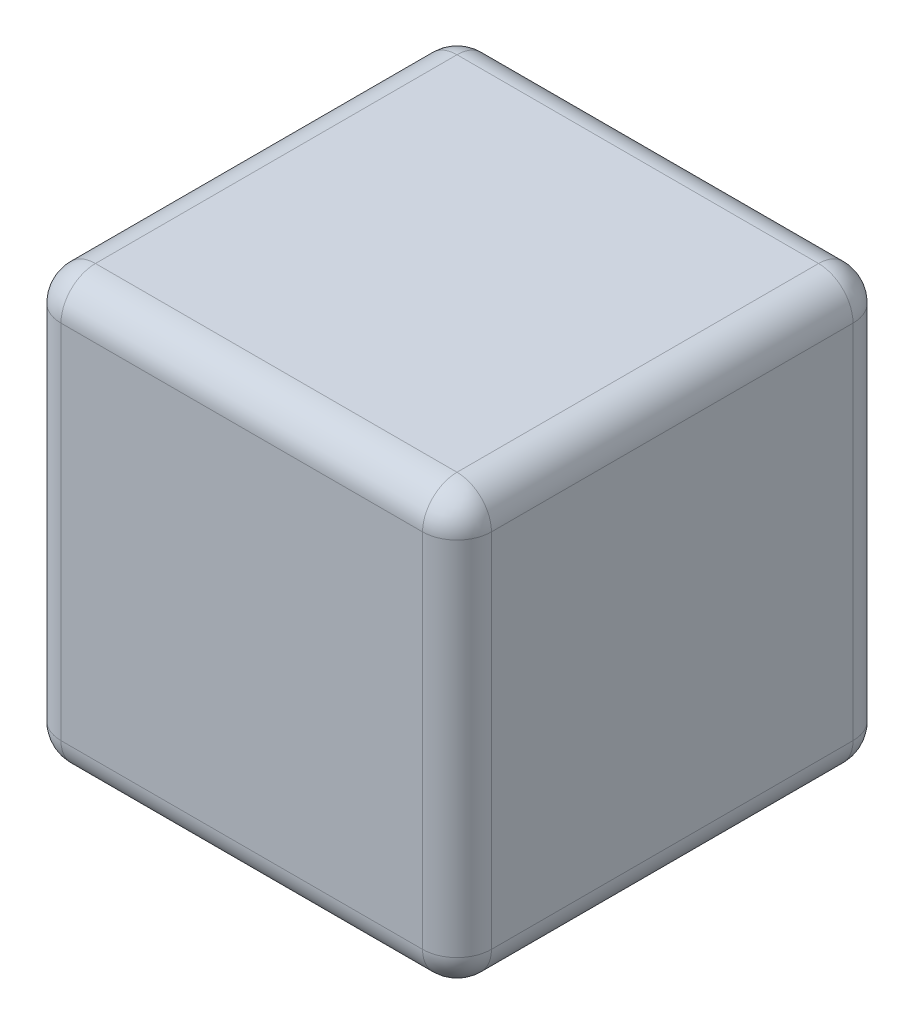
ISO-10303-21;
HEADER;
FILE_DESCRIPTION(('STEP AP214'),'2;1');
FILE_NAME('part.step','',(''),(''),'','','');
FILE_SCHEMA(('AUTOMOTIVE_DESIGN { 1 0 10303 214 1 1 1 1 }'));
ENDSEC;
DATA;
#1=APPLICATION_CONTEXT('core data for automotive mechanical design processes');
#2=APPLICATION_PROTOCOL_DEFINITION('international standard','automotive_design',2000,#1);
#3=PRODUCT_CONTEXT('',#1,'mechanical');
#4=PRODUCT('Part','Part','',(#3));
#5=PRODUCT_RELATED_PRODUCT_CATEGORY('part','',(#4));
#6=PRODUCT_DEFINITION_FORMATION('','',#4);
#7=PRODUCT_DEFINITION_CONTEXT('part definition',#1,'design');
#8=PRODUCT_DEFINITION('design','',#6,#7);
#9=PRODUCT_DEFINITION_SHAPE('','',#8);
#10=(LENGTH_UNIT() NAMED_UNIT(*) SI_UNIT(.MILLI.,.METRE.));
#11=(NAMED_UNIT(*) PLANE_ANGLE_UNIT() SI_UNIT($,.RADIAN.));
#12=(NAMED_UNIT(*) SI_UNIT($,.STERADIAN.) SOLID_ANGLE_UNIT());
#13=UNCERTAINTY_MEASURE_WITH_UNIT(LENGTH_MEASURE(1.E-05),#10,'distance_accuracy_value','');
#14=(GEOMETRIC_REPRESENTATION_CONTEXT(3) GLOBAL_UNCERTAINTY_ASSIGNED_CONTEXT((#13)) GLOBAL_UNIT_ASSIGNED_CONTEXT((#10,
#11,#12)) REPRESENTATION_CONTEXT('',''));
#15=CARTESIAN_POINT('',(0.,0.,0.));
#16=DIRECTION('',(0.,0.,1.));
#17=DIRECTION('',(1.,0.,0.));
#18=AXIS2_PLACEMENT_3D('',#15,#16,#17);
#19=CARTESIAN_POINT('',(31.75,31.75,0.));
#20=DIRECTION('',(0.,0.,-1.));
#21=DIRECTION('',(-1.,0.,0.));
#22=AXIS2_PLACEMENT_3D('',#19,#20,#21);
#23=PLANE('',#22);
#24=DIRECTION('',(0.,-1.,0.));
#25=VECTOR('',#24,1.);
#26=CARTESIAN_POINT('',(2.54,31.75,0.));
#27=LINE('',#26,#25);
#28=CARTESIAN_POINT('',(2.54,29.21,0.));
#29=VERTEX_POINT('',#28);
#30=CARTESIAN_POINT('',(2.54,2.54,0.));
#31=VERTEX_POINT('',#30);
#32=EDGE_CURVE('E170',#29,#31,#27,.T.);
#33=ORIENTED_EDGE('',*,*,#32,.T.);
#34=DIRECTION('',(1.,0.,0.));
#35=VECTOR('',#34,1.);
#36=CARTESIAN_POINT('',(31.75,2.54,0.));
#37=LINE('',#36,#35);
#38=CARTESIAN_POINT('',(29.21,2.54,0.));
#39=VERTEX_POINT('',#38);
#40=EDGE_CURVE('E140',#31,#39,#37,.T.);
#41=ORIENTED_EDGE('',*,*,#40,.T.);
#42=DIRECTION('',(0.,-1.,0.));
#43=VECTOR('',#42,1.);
#44=CARTESIAN_POINT('',(29.21,31.75,0.));
#45=LINE('',#44,#43);
#46=CARTESIAN_POINT('',(29.21,29.21,0.));
#47=VERTEX_POINT('',#46);
#48=EDGE_CURVE('E160',#39,#47,#45,.F.);
#49=ORIENTED_EDGE('',*,*,#48,.T.);
#50=DIRECTION('',(1.,0.,0.));
#51=VECTOR('',#50,1.);
#52=CARTESIAN_POINT('',(31.75,29.21,0.));
#53=LINE('',#52,#51);
#54=EDGE_CURVE('E167',#47,#29,#53,.F.);
#55=ORIENTED_EDGE('',*,*,#54,.T.);
#56=EDGE_LOOP('',(#33,#41,#49,#55));
#57=FACE_BOUND('',#56,.T.);
#58=ADVANCED_FACE('F45',(#57),#23,.F.);
#59=CARTESIAN_POINT('',(31.75,31.75,-31.75));
#60=DIRECTION('',(-1.,0.,0.));
#61=DIRECTION('',(0.,0.,1.));
#62=AXIS2_PLACEMENT_3D('',#59,#60,#61);
#63=PLANE('',#62);
#64=DIRECTION('',(0.,0.,-1.));
#65=VECTOR('',#64,1.);
#66=CARTESIAN_POINT('',(31.75,29.21,-31.75));
#67=LINE('',#66,#65);
#68=CARTESIAN_POINT('',(31.75,29.21,-29.21));
#69=VERTEX_POINT('',#68);
#70=CARTESIAN_POINT('',(31.75,29.21,-2.54));
#71=VERTEX_POINT('',#70);
#72=EDGE_CURVE('E55',#69,#71,#67,.F.);
#73=ORIENTED_EDGE('',*,*,#72,.T.);
#74=DIRECTION('',(0.,-1.,0.));
#75=VECTOR('',#74,1.);
#76=CARTESIAN_POINT('',(31.75,31.75,-2.54));
#77=LINE('',#76,#75);
#78=CARTESIAN_POINT('',(31.75,2.54,-2.54));
#79=VERTEX_POINT('',#78);
#80=EDGE_CURVE('E11',#71,#79,#77,.T.);
#81=ORIENTED_EDGE('',*,*,#80,.T.);
#82=DIRECTION('',(0.,0.,-1.));
#83=VECTOR('',#82,1.);
#84=CARTESIAN_POINT('',(31.75,2.54,-31.75));
#85=LINE('',#84,#83);
#86=CARTESIAN_POINT('',(31.75,2.54,-29.21));
#87=VERTEX_POINT('',#86);
#88=EDGE_CURVE('E228',#79,#87,#85,.T.);
#89=ORIENTED_EDGE('',*,*,#88,.T.);
#90=DIRECTION('',(0.,-1.,0.));
#91=VECTOR('',#90,1.);
#92=CARTESIAN_POINT('',(31.75,31.75,-29.21));
#93=LINE('',#92,#91);
#94=EDGE_CURVE('E66',#87,#69,#93,.F.);
#95=ORIENTED_EDGE('',*,*,#94,.T.);
#96=EDGE_LOOP('',(#73,#81,#89,#95));
#97=FACE_BOUND('',#96,.T.);
#98=ADVANCED_FACE('F368',(#97),#63,.F.);
#99=CARTESIAN_POINT('',(0.,31.75,-31.75));
#100=DIRECTION('',(0.,0.,1.));
#101=DIRECTION('',(1.,0.,0.));
#102=AXIS2_PLACEMENT_3D('',#99,#100,#101);
#103=PLANE('',#102);
#104=DIRECTION('',(-1.,0.,0.));
#105=VECTOR('',#104,1.);
#106=CARTESIAN_POINT('',(0.,2.54,-31.75));
#107=LINE('',#106,#105);
#108=CARTESIAN_POINT('',(29.21,2.54,-31.75));
#109=VERTEX_POINT('',#108);
#110=CARTESIAN_POINT('',(2.54,2.54,-31.75));
#111=VERTEX_POINT('',#110);
#112=EDGE_CURVE('E208',#109,#111,#107,.T.);
#113=ORIENTED_EDGE('',*,*,#112,.T.);
#114=DIRECTION('',(0.,-1.,0.));
#115=VECTOR('',#114,1.);
#116=CARTESIAN_POINT('',(2.54,31.75,-31.75));
#117=LINE('',#116,#115);
#118=CARTESIAN_POINT('',(2.54,29.21,-31.75));
#119=VERTEX_POINT('',#118);
#120=EDGE_CURVE('E211',#111,#119,#117,.F.);
#121=ORIENTED_EDGE('',*,*,#120,.T.);
#122=DIRECTION('',(-1.,0.,0.));
#123=VECTOR('',#122,1.);
#124=CARTESIAN_POINT('',(0.,29.21,-31.75));
#125=LINE('',#124,#123);
#126=CARTESIAN_POINT('',(29.21,29.21,-31.75));
#127=VERTEX_POINT('',#126);
#128=EDGE_CURVE('E205',#119,#127,#125,.F.);
#129=ORIENTED_EDGE('',*,*,#128,.T.);
#130=DIRECTION('',(0.,-1.,0.));
#131=VECTOR('',#130,1.);
#132=CARTESIAN_POINT('',(29.21,31.75,-31.75));
#133=LINE('',#132,#131);
#134=EDGE_CURVE('E202',#127,#109,#133,.T.);
#135=ORIENTED_EDGE('',*,*,#134,.T.);
#136=EDGE_LOOP('',(#113,#121,#129,#135));
#137=FACE_BOUND('',#136,.T.);
#138=ADVANCED_FACE('F324',(#137),#103,.F.);
#139=CARTESIAN_POINT('',(0.,31.75,0.));
#140=DIRECTION('',(1.,0.,0.));
#141=DIRECTION('',(0.,0.,-1.));
#142=AXIS2_PLACEMENT_3D('',#139,#140,#141);
#143=PLANE('',#142);
#144=DIRECTION('',(0.,0.,1.));
#145=VECTOR('',#144,1.);
#146=CARTESIAN_POINT('',(0.,2.54,0.));
#147=LINE('',#146,#145);
#148=CARTESIAN_POINT('',(0.,2.54,-29.21));
#149=VERTEX_POINT('',#148);
#150=CARTESIAN_POINT('',(0.,2.54,-2.54));
#151=VERTEX_POINT('',#150);
#152=EDGE_CURVE('E195',#149,#151,#147,.T.);
#153=ORIENTED_EDGE('',*,*,#152,.T.);
#154=DIRECTION('',(0.,-1.,0.));
#155=VECTOR('',#154,1.);
#156=CARTESIAN_POINT('',(0.,31.75,-2.54));
#157=LINE('',#156,#155);
#158=CARTESIAN_POINT('',(0.,29.21,-2.54));
#159=VERTEX_POINT('',#158);
#160=EDGE_CURVE('E198',#151,#159,#157,.F.);
#161=ORIENTED_EDGE('',*,*,#160,.T.);
#162=DIRECTION('',(0.,0.,1.));
#163=VECTOR('',#162,1.);
#164=CARTESIAN_POINT('',(0.,29.21,0.));
#165=LINE('',#164,#163);
#166=CARTESIAN_POINT('',(0.,29.21,-29.21));
#167=VERTEX_POINT('',#166);
#168=EDGE_CURVE('E189',#159,#167,#165,.F.);
#169=ORIENTED_EDGE('',*,*,#168,.T.);
#170=DIRECTION('',(0.,-1.,0.));
#171=VECTOR('',#170,1.);
#172=CARTESIAN_POINT('',(0.,31.75,-29.21));
#173=LINE('',#172,#171);
#174=EDGE_CURVE('E192',#167,#149,#173,.T.);
#175=ORIENTED_EDGE('',*,*,#174,.T.);
#176=EDGE_LOOP('',(#153,#161,#169,#175));
#177=FACE_BOUND('',#176,.T.);
#178=ADVANCED_FACE('F345',(#177),#143,.F.);
#179=CARTESIAN_POINT('',(0.,31.75,0.));
#180=DIRECTION('',(0.,-1.,0.));
#181=DIRECTION('',(0.,0.,-1.));
#182=AXIS2_PLACEMENT_3D('',#179,#180,#181);
#183=PLANE('',#182);
#184=DIRECTION('',(-1.,0.,0.));
#185=VECTOR('',#184,1.);
#186=CARTESIAN_POINT('',(0.,31.75,-29.21));
#187=LINE('',#186,#185);
#188=CARTESIAN_POINT('',(29.21,31.75,-29.21));
#189=VERTEX_POINT('',#188);
#190=CARTESIAN_POINT('',(2.54,31.75,-29.21));
#191=VERTEX_POINT('',#190);
#192=EDGE_CURVE('E221',#189,#191,#187,.T.);
#193=ORIENTED_EDGE('',*,*,#192,.T.);
#194=DIRECTION('',(0.,0.,1.));
#195=VECTOR('',#194,1.);
#196=CARTESIAN_POINT('',(2.54,31.75,0.));
#197=LINE('',#196,#195);
#198=CARTESIAN_POINT('',(2.54,31.75,-2.54));
#199=VERTEX_POINT('',#198);
#200=EDGE_CURVE('E224',#191,#199,#197,.T.);
#201=ORIENTED_EDGE('',*,*,#200,.T.);
#202=DIRECTION('',(1.,0.,0.));
#203=VECTOR('',#202,1.);
#204=CARTESIAN_POINT('',(0.,31.75,-2.54));
#205=LINE('',#204,#203);
#206=CARTESIAN_POINT('',(29.21,31.75,-2.54));
#207=VERTEX_POINT('',#206);
#208=EDGE_CURVE('E218',#199,#207,#205,.T.);
#209=ORIENTED_EDGE('',*,*,#208,.T.);
#210=DIRECTION('',(0.,0.,-1.));
#211=VECTOR('',#210,1.);
#212=CARTESIAN_POINT('',(29.21,31.75,0.));
#213=LINE('',#212,#211);
#214=EDGE_CURVE('E215',#207,#189,#213,.T.);
#215=ORIENTED_EDGE('',*,*,#214,.T.);
#216=EDGE_LOOP('',(#193,#201,#209,#215));
#217=FACE_BOUND('',#216,.T.);
#218=ADVANCED_FACE('F359',(#217),#183,.F.);
#219=CARTESIAN_POINT('',(0.,0.,0.));
#220=DIRECTION('',(0.,-1.,0.));
#221=DIRECTION('',(0.,0.,-1.));
#222=AXIS2_PLACEMENT_3D('',#219,#220,#221);
#223=PLANE('',#222);
#224=DIRECTION('',(0.,0.,-1.));
#225=VECTOR('',#224,1.);
#226=CARTESIAN_POINT('',(29.21,0.,0.));
#227=LINE('',#226,#225);
#228=CARTESIAN_POINT('',(29.21,0.,-29.21));
#229=VERTEX_POINT('',#228);
#230=CARTESIAN_POINT('',(29.21,0.,-2.54));
#231=VERTEX_POINT('',#230);
#232=EDGE_CURVE('E173',#229,#231,#227,.F.);
#233=ORIENTED_EDGE('',*,*,#232,.T.);
#234=DIRECTION('',(1.,0.,0.));
#235=VECTOR('',#234,1.);
#236=CARTESIAN_POINT('',(0.,0.,-2.54));
#237=LINE('',#236,#235);
#238=CARTESIAN_POINT('',(2.54,0.,-2.54));
#239=VERTEX_POINT('',#238);
#240=EDGE_CURVE('E142',#231,#239,#237,.F.);
#241=ORIENTED_EDGE('',*,*,#240,.T.);
#242=DIRECTION('',(0.,0.,1.));
#243=VECTOR('',#242,1.);
#244=CARTESIAN_POINT('',(2.54,0.,-31.75));
#245=LINE('',#244,#243);
#246=CARTESIAN_POINT('',(2.54,0.,-29.21));
#247=VERTEX_POINT('',#246);
#248=EDGE_CURVE('E184',#239,#247,#245,.F.);
#249=ORIENTED_EDGE('',*,*,#248,.T.);
#250=DIRECTION('',(-1.,0.,0.));
#251=VECTOR('',#250,1.);
#252=CARTESIAN_POINT('',(31.75,0.,-29.21));
#253=LINE('',#252,#251);
#254=EDGE_CURVE('E177',#247,#229,#253,.F.);
#255=ORIENTED_EDGE('',*,*,#254,.T.);
#256=EDGE_LOOP('',(#233,#241,#249,#255));
#257=FACE_BOUND('',#256,.T.);
#258=ADVANCED_FACE('F379',(#257),#223,.T.);
#259=CARTESIAN_POINT('',(0.,29.21,-29.21));
#260=DIRECTION('',(-1.,0.,0.));
#261=DIRECTION('',(0.,0.,1.));
#262=AXIS2_PLACEMENT_3D('',#259,#260,#261);
#263=CYLINDRICAL_SURFACE('',#262,2.54);
#264=CARTESIAN_POINT('',(2.54,29.21,-29.21));
#265=DIRECTION('',(-1.,0.,0.));
#266=DIRECTION('',(0.,0.,1.));
#267=AXIS2_PLACEMENT_3D('',#264,#265,#266);
#268=CIRCLE('',#267,2.54);
#269=EDGE_CURVE('E49',#191,#119,#268,.T.);
#270=ORIENTED_EDGE('',*,*,#269,.F.);
#271=ORIENTED_EDGE('',*,*,#192,.F.);
#272=CARTESIAN_POINT('',(29.21,29.21,-29.21));
#273=DIRECTION('',(1.,0.,0.));
#274=DIRECTION('',(0.,0.,-1.));
#275=AXIS2_PLACEMENT_3D('',#272,#273,#274);
#276=CIRCLE('',#275,2.54);
#277=EDGE_CURVE('E303',#127,#189,#276,.T.);
#278=ORIENTED_EDGE('',*,*,#277,.F.);
#279=ORIENTED_EDGE('',*,*,#128,.F.);
#280=EDGE_LOOP('',(#270,#271,#278,#279));
#281=FACE_BOUND('',#280,.T.);
#282=ADVANCED_FACE('F47',(#281),#263,.T.);
#283=CARTESIAN_POINT('',(2.54,29.21,-29.21));
#284=DIRECTION('',(0.,0.,-1.));
#285=DIRECTION('',(-1.,0.,0.));
#286=AXIS2_PLACEMENT_3D('',#283,#284,#285);
#287=SPHERICAL_SURFACE('',#286,2.54);
#288=CARTESIAN_POINT('',(2.54,29.21,-29.21));
#289=DIRECTION('',(0.,0.,-1.));
#290=DIRECTION('',(-1.,0.,0.));
#291=AXIS2_PLACEMENT_3D('',#288,#289,#290);
#292=CIRCLE('',#291,2.54);
#293=EDGE_CURVE('E297',#191,#167,#292,.F.);
#294=ORIENTED_EDGE('',*,*,#293,.F.);
#295=ORIENTED_EDGE('',*,*,#269,.T.);
#296=CARTESIAN_POINT('',(2.54,29.21,-29.21));
#297=DIRECTION('',(0.,1.,0.));
#298=DIRECTION('',(0.,0.,1.));
#299=AXIS2_PLACEMENT_3D('',#296,#297,#298);
#300=CIRCLE('',#299,2.54);
#301=EDGE_CURVE('E301',#167,#119,#300,.F.);
#302=ORIENTED_EDGE('',*,*,#301,.F.);
#303=EDGE_LOOP('',(#294,#295,#302));
#304=FACE_BOUND('',#303,.T.);
#305=ADVANCED_FACE('F317',(#304),#287,.T.);
#306=CARTESIAN_POINT('',(29.21,29.21,-29.21));
#307=DIRECTION('',(0.,1.,0.));
#308=DIRECTION('',(0.,0.,1.));
#309=AXIS2_PLACEMENT_3D('',#306,#307,#308);
#310=SPHERICAL_SURFACE('',#309,2.54);
#311=CARTESIAN_POINT('',(29.21,29.21,-29.21));
#312=DIRECTION('',(0.,1.,0.));
#313=DIRECTION('',(0.,0.,1.));
#314=AXIS2_PLACEMENT_3D('',#311,#312,#313);
#315=CIRCLE('',#314,2.54);
#316=EDGE_CURVE('E290',#127,#69,#315,.F.);
#317=ORIENTED_EDGE('',*,*,#316,.F.);
#318=ORIENTED_EDGE('',*,*,#277,.T.);
#319=CARTESIAN_POINT('',(29.21,29.21,-29.21));
#320=DIRECTION('',(0.,0.,-1.));
#321=DIRECTION('',(-1.,0.,0.));
#322=AXIS2_PLACEMENT_3D('',#319,#320,#321);
#323=CIRCLE('',#322,2.54);
#324=EDGE_CURVE('E293',#69,#189,#323,.F.);
#325=ORIENTED_EDGE('',*,*,#324,.F.);
#326=EDGE_LOOP('',(#317,#318,#325));
#327=FACE_BOUND('',#326,.T.);
#328=ADVANCED_FACE('F432',(#327),#310,.T.);
#329=CARTESIAN_POINT('',(2.54,31.75,-29.21));
#330=DIRECTION('',(0.,-1.,0.));
#331=DIRECTION('',(0.,0.,-1.));
#332=AXIS2_PLACEMENT_3D('',#329,#330,#331);
#333=CYLINDRICAL_SURFACE('',#332,2.54);
#334=ORIENTED_EDGE('',*,*,#301,.T.);
#335=ORIENTED_EDGE('',*,*,#120,.F.);
#336=CARTESIAN_POINT('',(2.54,2.54,-29.21));
#337=DIRECTION('',(0.,-1.,0.));
#338=DIRECTION('',(0.,0.,-1.));
#339=AXIS2_PLACEMENT_3D('',#336,#337,#338);
#340=CIRCLE('',#339,2.54);
#341=EDGE_CURVE('E282',#149,#111,#340,.T.);
#342=ORIENTED_EDGE('',*,*,#341,.F.);
#343=ORIENTED_EDGE('',*,*,#174,.F.);
#344=EDGE_LOOP('',(#334,#335,#342,#343));
#345=FACE_BOUND('',#344,.T.);
#346=ADVANCED_FACE('F329',(#345),#333,.T.);
#347=CARTESIAN_POINT('',(2.54,29.21,0.));
#348=DIRECTION('',(0.,0.,1.));
#349=DIRECTION('',(1.,0.,0.));
#350=AXIS2_PLACEMENT_3D('',#347,#348,#349);
#351=CYLINDRICAL_SURFACE('',#350,2.54);
#352=ORIENTED_EDGE('',*,*,#293,.T.);
#353=ORIENTED_EDGE('',*,*,#168,.F.);
#354=CARTESIAN_POINT('',(2.54,29.21,-2.54));
#355=DIRECTION('',(0.,0.,1.));
#356=DIRECTION('',(1.,0.,0.));
#357=AXIS2_PLACEMENT_3D('',#354,#355,#356);
#358=CIRCLE('',#357,2.54);
#359=EDGE_CURVE('E278',#199,#159,#358,.T.);
#360=ORIENTED_EDGE('',*,*,#359,.F.);
#361=ORIENTED_EDGE('',*,*,#200,.F.);
#362=EDGE_LOOP('',(#352,#353,#360,#361));
#363=FACE_BOUND('',#362,.T.);
#364=ADVANCED_FACE('F357',(#363),#351,.T.);
#365=CARTESIAN_POINT('',(0.,29.21,-2.54));
#366=DIRECTION('',(1.,0.,0.));
#367=DIRECTION('',(0.,0.,-1.));
#368=AXIS2_PLACEMENT_3D('',#365,#366,#367);
#369=CYLINDRICAL_SURFACE('',#368,2.54);
#370=CARTESIAN_POINT('',(29.21,29.21,-2.54));
#371=DIRECTION('',(1.,0.,0.));
#372=DIRECTION('',(0.,0.,-1.));
#373=AXIS2_PLACEMENT_3D('',#370,#371,#372);
#374=CIRCLE('',#373,2.54);
#375=EDGE_CURVE('E271',#207,#47,#374,.T.);
#376=ORIENTED_EDGE('',*,*,#375,.F.);
#377=ORIENTED_EDGE('',*,*,#208,.F.);
#378=CARTESIAN_POINT('',(2.54,29.21,-2.54));
#379=DIRECTION('',(-1.,0.,0.));
#380=DIRECTION('',(0.,-1.,0.));
#381=AXIS2_PLACEMENT_3D('',#378,#379,#380);
#382=CIRCLE('',#381,2.54);
#383=EDGE_CURVE('E275',#29,#199,#382,.T.);
#384=ORIENTED_EDGE('',*,*,#383,.F.);
#385=ORIENTED_EDGE('',*,*,#54,.F.);
#386=EDGE_LOOP('',(#376,#377,#384,#385));
#387=FACE_BOUND('',#386,.T.);
#388=ADVANCED_FACE('F365',(#387),#369,.T.);
#389=CARTESIAN_POINT('',(29.21,29.21,0.));
#390=DIRECTION('',(0.,0.,-1.));
#391=DIRECTION('',(-1.,0.,0.));
#392=AXIS2_PLACEMENT_3D('',#389,#390,#391);
#393=CYLINDRICAL_SURFACE('',#392,2.54);
#394=ORIENTED_EDGE('',*,*,#324,.T.);
#395=ORIENTED_EDGE('',*,*,#214,.F.);
#396=CARTESIAN_POINT('',(29.21,29.21,-2.54));
#397=DIRECTION('',(0.,0.,1.));
#398=DIRECTION('',(0.,-1.,0.));
#399=AXIS2_PLACEMENT_3D('',#396,#397,#398);
#400=CIRCLE('',#399,2.54);
#401=EDGE_CURVE('E267',#71,#207,#400,.T.);
#402=ORIENTED_EDGE('',*,*,#401,.F.);
#403=ORIENTED_EDGE('',*,*,#72,.F.);
#404=EDGE_LOOP('',(#394,#395,#402,#403));
#405=FACE_BOUND('',#404,.T.);
#406=ADVANCED_FACE('F363',(#405),#393,.T.);
#407=CARTESIAN_POINT('',(29.21,31.75,-29.21));
#408=DIRECTION('',(0.,-1.,0.));
#409=DIRECTION('',(0.,0.,-1.));
#410=AXIS2_PLACEMENT_3D('',#407,#408,#409);
#411=CYLINDRICAL_SURFACE('',#410,2.54);
#412=ORIENTED_EDGE('',*,*,#316,.T.);
#413=ORIENTED_EDGE('',*,*,#94,.F.);
#414=CARTESIAN_POINT('',(29.21,2.54,-29.21));
#415=DIRECTION('',(0.,-1.,0.));
#416=DIRECTION('',(0.,0.,-1.));
#417=AXIS2_PLACEMENT_3D('',#414,#415,#416);
#418=CIRCLE('',#417,2.54);
#419=EDGE_CURVE('E263',#109,#87,#418,.T.);
#420=ORIENTED_EDGE('',*,*,#419,.F.);
#421=ORIENTED_EDGE('',*,*,#134,.F.);
#422=EDGE_LOOP('',(#412,#413,#420,#421));
#423=FACE_BOUND('',#422,.T.);
#424=ADVANCED_FACE('F371',(#423),#411,.T.);
#425=CARTESIAN_POINT('',(0.,2.54,-29.21));
#426=DIRECTION('',(1.,0.,0.));
#427=DIRECTION('',(0.,0.,-1.));
#428=AXIS2_PLACEMENT_3D('',#425,#426,#427);
#429=CYLINDRICAL_SURFACE('',#428,2.54);
#430=CARTESIAN_POINT('',(2.54,2.54,-29.21));
#431=DIRECTION('',(-1.,0.,0.));
#432=DIRECTION('',(0.,0.,1.));
#433=AXIS2_PLACEMENT_3D('',#430,#431,#432);
#434=CIRCLE('',#433,2.54);
#435=EDGE_CURVE('E286',#111,#247,#434,.T.);
#436=ORIENTED_EDGE('',*,*,#435,.F.);
#437=ORIENTED_EDGE('',*,*,#112,.F.);
#438=CARTESIAN_POINT('',(29.21,2.54,-29.21));
#439=DIRECTION('',(1.,0.,0.));
#440=DIRECTION('',(0.,0.,-1.));
#441=AXIS2_PLACEMENT_3D('',#438,#439,#440);
#442=CIRCLE('',#441,2.54);
#443=EDGE_CURVE('E259',#229,#109,#442,.T.);
#444=ORIENTED_EDGE('',*,*,#443,.F.);
#445=ORIENTED_EDGE('',*,*,#254,.F.);
#446=EDGE_LOOP('',(#436,#437,#444,#445));
#447=FACE_BOUND('',#446,.T.);
#448=ADVANCED_FACE('F333',(#447),#429,.T.);
#449=CARTESIAN_POINT('',(2.54,2.54,-29.21));
#450=DIRECTION('',(0.,0.,-1.));
#451=DIRECTION('',(0.,1.,0.));
#452=AXIS2_PLACEMENT_3D('',#449,#450,#451);
#453=SPHERICAL_SURFACE('',#452,2.54);
#454=ORIENTED_EDGE('',*,*,#341,.T.);
#455=ORIENTED_EDGE('',*,*,#435,.T.);
#456=CARTESIAN_POINT('',(2.54,2.54,-29.21));
#457=DIRECTION('',(0.,0.,-1.));
#458=DIRECTION('',(-1.,0.,0.));
#459=AXIS2_PLACEMENT_3D('',#456,#457,#458);
#460=CIRCLE('',#459,2.54);
#461=EDGE_CURVE('E255',#149,#247,#460,.F.);
#462=ORIENTED_EDGE('',*,*,#461,.F.);
#463=EDGE_LOOP('',(#454,#455,#462));
#464=FACE_BOUND('',#463,.T.);
#465=ADVANCED_FACE('F337',(#464),#453,.T.);
#466=CARTESIAN_POINT('',(2.54,29.21,-2.54));
#467=DIRECTION('',(0.,1.,0.));
#468=DIRECTION('',(0.,0.,1.));
#469=AXIS2_PLACEMENT_3D('',#466,#467,#468);
#470=SPHERICAL_SURFACE('',#469,2.54);
#471=ORIENTED_EDGE('',*,*,#383,.T.);
#472=ORIENTED_EDGE('',*,*,#359,.T.);
#473=CARTESIAN_POINT('',(2.54,29.21,-2.54));
#474=DIRECTION('',(0.,1.,0.));
#475=DIRECTION('',(0.,0.,1.));
#476=AXIS2_PLACEMENT_3D('',#473,#474,#475);
#477=CIRCLE('',#476,2.54);
#478=EDGE_CURVE('E252',#29,#159,#477,.F.);
#479=ORIENTED_EDGE('',*,*,#478,.F.);
#480=EDGE_LOOP('',(#471,#472,#479));
#481=FACE_BOUND('',#480,.T.);
#482=ADVANCED_FACE('F353',(#481),#470,.T.);
#483=CARTESIAN_POINT('',(29.21,29.21,-2.54));
#484=DIRECTION('',(0.,1.,0.));
#485=DIRECTION('',(0.,0.,1.));
#486=AXIS2_PLACEMENT_3D('',#483,#484,#485);
#487=SPHERICAL_SURFACE('',#486,2.54);
#488=ORIENTED_EDGE('',*,*,#401,.T.);
#489=ORIENTED_EDGE('',*,*,#375,.T.);
#490=CARTESIAN_POINT('',(29.21,29.21,-2.54));
#491=DIRECTION('',(0.,1.,0.));
#492=DIRECTION('',(0.,0.,1.));
#493=AXIS2_PLACEMENT_3D('',#490,#491,#492);
#494=CIRCLE('',#493,2.54);
#495=EDGE_CURVE('E163',#71,#47,#494,.F.);
#496=ORIENTED_EDGE('',*,*,#495,.F.);
#497=EDGE_LOOP('',(#488,#489,#496));
#498=FACE_BOUND('',#497,.T.);
#499=ADVANCED_FACE('F367',(#498),#487,.T.);
#500=CARTESIAN_POINT('',(29.21,2.54,-29.21));
#501=DIRECTION('',(0.,0.,-1.));
#502=DIRECTION('',(0.,1.,0.));
#503=AXIS2_PLACEMENT_3D('',#500,#501,#502);
#504=SPHERICAL_SURFACE('',#503,2.54);
#505=ORIENTED_EDGE('',*,*,#443,.T.);
#506=ORIENTED_EDGE('',*,*,#419,.T.);
#507=CARTESIAN_POINT('',(29.21,2.54,-29.21));
#508=DIRECTION('',(0.,0.,-1.));
#509=DIRECTION('',(-1.,0.,0.));
#510=AXIS2_PLACEMENT_3D('',#507,#508,#509);
#511=CIRCLE('',#510,2.54);
#512=EDGE_CURVE('E246',#229,#87,#511,.F.);
#513=ORIENTED_EDGE('',*,*,#512,.F.);
#514=EDGE_LOOP('',(#505,#506,#513));
#515=FACE_BOUND('',#514,.T.);
#516=ADVANCED_FACE('F375',(#515),#504,.T.);
#517=CARTESIAN_POINT('',(2.54,2.54,0.));
#518=DIRECTION('',(0.,0.,-1.));
#519=DIRECTION('',(-1.,0.,0.));
#520=AXIS2_PLACEMENT_3D('',#517,#518,#519);
#521=CYLINDRICAL_SURFACE('',#520,2.54);
#522=ORIENTED_EDGE('',*,*,#461,.T.);
#523=ORIENTED_EDGE('',*,*,#248,.F.);
#524=CARTESIAN_POINT('',(2.54,2.54,-2.54));
#525=DIRECTION('',(0.,0.,1.));
#526=DIRECTION('',(1.,0.,0.));
#527=AXIS2_PLACEMENT_3D('',#524,#525,#526);
#528=CIRCLE('',#527,2.54);
#529=EDGE_CURVE('E242',#151,#239,#528,.T.);
#530=ORIENTED_EDGE('',*,*,#529,.F.);
#531=ORIENTED_EDGE('',*,*,#152,.F.);
#532=EDGE_LOOP('',(#522,#523,#530,#531));
#533=FACE_BOUND('',#532,.T.);
#534=ADVANCED_FACE('F342',(#533),#521,.T.);
#535=CARTESIAN_POINT('',(2.54,31.75,-2.54));
#536=DIRECTION('',(0.,-1.,0.));
#537=DIRECTION('',(0.,0.,-1.));
#538=AXIS2_PLACEMENT_3D('',#535,#536,#537);
#539=CYLINDRICAL_SURFACE('',#538,2.54);
#540=ORIENTED_EDGE('',*,*,#478,.T.);
#541=ORIENTED_EDGE('',*,*,#160,.F.);
#542=CARTESIAN_POINT('',(2.54,2.54,-2.54));
#543=DIRECTION('',(0.,-1.,0.));
#544=DIRECTION('',(0.,0.,-1.));
#545=AXIS2_PLACEMENT_3D('',#542,#543,#544);
#546=CIRCLE('',#545,2.54);
#547=EDGE_CURVE('E157',#31,#151,#546,.T.);
#548=ORIENTED_EDGE('',*,*,#547,.F.);
#549=ORIENTED_EDGE('',*,*,#32,.F.);
#550=EDGE_LOOP('',(#540,#541,#548,#549));
#551=FACE_BOUND('',#550,.T.);
#552=ADVANCED_FACE('F347',(#551),#539,.T.);
#553=CARTESIAN_POINT('',(29.21,31.75,-2.54));
#554=DIRECTION('',(0.,-1.,0.));
#555=DIRECTION('',(0.,0.,-1.));
#556=AXIS2_PLACEMENT_3D('',#553,#554,#555);
#557=CYLINDRICAL_SURFACE('',#556,2.54);
#558=ORIENTED_EDGE('',*,*,#495,.T.);
#559=ORIENTED_EDGE('',*,*,#48,.F.);
#560=CARTESIAN_POINT('',(29.21,2.54,-2.54));
#561=DIRECTION('',(0.,-1.,0.));
#562=DIRECTION('',(0.,0.,-1.));
#563=AXIS2_PLACEMENT_3D('',#560,#561,#562);
#564=CIRCLE('',#563,2.54);
#565=EDGE_CURVE('E148',#79,#39,#564,.T.);
#566=ORIENTED_EDGE('',*,*,#565,.F.);
#567=ORIENTED_EDGE('',*,*,#80,.F.);
#568=EDGE_LOOP('',(#558,#559,#566,#567));
#569=FACE_BOUND('',#568,.T.);
#570=ADVANCED_FACE('F161',(#569),#557,.T.);
#571=CARTESIAN_POINT('',(29.21,2.54,-31.75));
#572=DIRECTION('',(0.,0.,1.));
#573=DIRECTION('',(1.,0.,0.));
#574=AXIS2_PLACEMENT_3D('',#571,#572,#573);
#575=CYLINDRICAL_SURFACE('',#574,2.54);
#576=ORIENTED_EDGE('',*,*,#512,.T.);
#577=ORIENTED_EDGE('',*,*,#88,.F.);
#578=CARTESIAN_POINT('',(29.21,2.54,-2.54));
#579=DIRECTION('',(0.,0.,1.));
#580=DIRECTION('',(1.,0.,0.));
#581=AXIS2_PLACEMENT_3D('',#578,#579,#580);
#582=CIRCLE('',#581,2.54);
#583=EDGE_CURVE('E152',#231,#79,#582,.T.);
#584=ORIENTED_EDGE('',*,*,#583,.F.);
#585=ORIENTED_EDGE('',*,*,#232,.F.);
#586=EDGE_LOOP('',(#576,#577,#584,#585));
#587=FACE_BOUND('',#586,.T.);
#588=ADVANCED_FACE('F377',(#587),#575,.T.);
#589=CARTESIAN_POINT('',(2.54,2.54,-2.54));
#590=DIRECTION('',(-1.,0.,0.));
#591=DIRECTION('',(0.,-1.,0.));
#592=AXIS2_PLACEMENT_3D('',#589,#590,#591);
#593=SPHERICAL_SURFACE('',#592,2.54);
#594=ORIENTED_EDGE('',*,*,#547,.T.);
#595=ORIENTED_EDGE('',*,*,#529,.T.);
#596=CARTESIAN_POINT('',(2.54,2.54,-2.54));
#597=DIRECTION('',(-1.,0.,0.));
#598=DIRECTION('',(0.,0.,1.));
#599=AXIS2_PLACEMENT_3D('',#596,#597,#598);
#600=CIRCLE('',#599,2.54);
#601=EDGE_CURVE('E145',#31,#239,#600,.F.);
#602=ORIENTED_EDGE('',*,*,#601,.F.);
#603=EDGE_LOOP('',(#594,#595,#602));
#604=FACE_BOUND('',#603,.T.);
#605=ADVANCED_FACE('F400',(#604),#593,.T.);
#606=CARTESIAN_POINT('',(29.21,2.54,-2.54));
#607=DIRECTION('',(1.,0.,0.));
#608=DIRECTION('',(0.,0.,-1.));
#609=AXIS2_PLACEMENT_3D('',#606,#607,#608);
#610=SPHERICAL_SURFACE('',#609,2.54);
#611=ORIENTED_EDGE('',*,*,#583,.T.);
#612=ORIENTED_EDGE('',*,*,#565,.T.);
#613=CARTESIAN_POINT('',(29.21,2.54,-2.54));
#614=DIRECTION('',(1.,0.,0.));
#615=DIRECTION('',(0.,0.,-1.));
#616=AXIS2_PLACEMENT_3D('',#613,#614,#615);
#617=CIRCLE('',#616,2.54);
#618=EDGE_CURVE('E136',#231,#39,#617,.F.);
#619=ORIENTED_EDGE('',*,*,#618,.F.);
#620=EDGE_LOOP('',(#611,#612,#619));
#621=FACE_BOUND('',#620,.T.);
#622=ADVANCED_FACE('F150',(#621),#610,.T.);
#623=CARTESIAN_POINT('',(31.75,2.54,-2.54));
#624=DIRECTION('',(-1.,0.,0.));
#625=DIRECTION('',(0.,0.,1.));
#626=AXIS2_PLACEMENT_3D('',#623,#624,#625);
#627=CYLINDRICAL_SURFACE('',#626,2.54);
#628=ORIENTED_EDGE('',*,*,#601,.T.);
#629=ORIENTED_EDGE('',*,*,#240,.F.);
#630=ORIENTED_EDGE('',*,*,#618,.T.);
#631=ORIENTED_EDGE('',*,*,#40,.F.);
#632=EDGE_LOOP('',(#628,#629,#630,#631));
#633=FACE_BOUND('',#632,.T.);
#634=ADVANCED_FACE('F138',(#633),#627,.T.);
#635=CLOSED_SHELL('',(#58,#98,#138,#178,#218,#258,#282,#305,#328,#346,#364,#388,#406,#424,#448,
#465,#482,#499,#516,#534,#552,#570,#588,#605,#622,#634));
#636=MANIFOLD_SOLID_BREP('B2',#635);
#637=ADVANCED_BREP_SHAPE_REPRESENTATION('',(#18,#636),#14);
#638=SHAPE_DEFINITION_REPRESENTATION(#9,#637);
ENDSEC;
END-ISO-10303-21;
